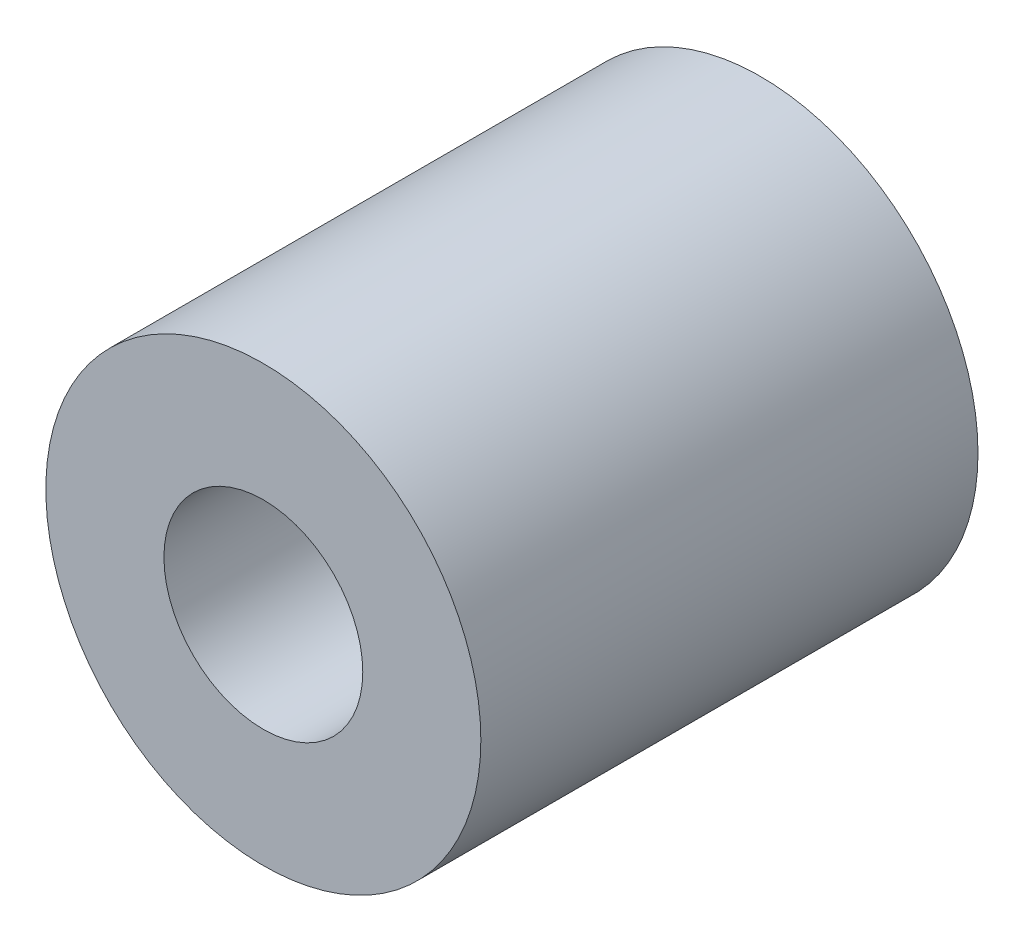
ISO-10303-21;
HEADER;
FILE_DESCRIPTION(('STEP AP214'),'2;1');
FILE_NAME('part.step','',(''),(''),'','','');
FILE_SCHEMA(('AUTOMOTIVE_DESIGN { 1 0 10303 214 1 1 1 1 }'));
ENDSEC;
DATA;
#1=APPLICATION_CONTEXT('core data for automotive mechanical design processes');
#2=APPLICATION_PROTOCOL_DEFINITION('international standard','automotive_design',2000,#1);
#3=PRODUCT_CONTEXT('',#1,'mechanical');
#4=PRODUCT('Part','Part','',(#3));
#5=PRODUCT_RELATED_PRODUCT_CATEGORY('part','',(#4));
#6=PRODUCT_DEFINITION_FORMATION('','',#4);
#7=PRODUCT_DEFINITION_CONTEXT('part definition',#1,'design');
#8=PRODUCT_DEFINITION('design','',#6,#7);
#9=PRODUCT_DEFINITION_SHAPE('','',#8);
#10=(LENGTH_UNIT() NAMED_UNIT(*) SI_UNIT(.MILLI.,.METRE.));
#11=(NAMED_UNIT(*) PLANE_ANGLE_UNIT() SI_UNIT($,.RADIAN.));
#12=(NAMED_UNIT(*) SI_UNIT($,.STERADIAN.) SOLID_ANGLE_UNIT());
#13=UNCERTAINTY_MEASURE_WITH_UNIT(LENGTH_MEASURE(1.E-05),#10,'distance_accuracy_value','');
#14=(GEOMETRIC_REPRESENTATION_CONTEXT(3) GLOBAL_UNCERTAINTY_ASSIGNED_CONTEXT((#13)) GLOBAL_UNIT_ASSIGNED_CONTEXT((#10,
#11,#12)) REPRESENTATION_CONTEXT('',''));
#15=CARTESIAN_POINT('',(0.,0.,0.));
#16=DIRECTION('',(0.,0.,1.));
#17=DIRECTION('',(1.,0.,0.));
#18=AXIS2_PLACEMENT_3D('',#15,#16,#17);
#19=CARTESIAN_POINT('',(0.,0.,4.));
#20=DIRECTION('',(0.,0.,1.));
#21=DIRECTION('',(1.,0.,0.));
#22=AXIS2_PLACEMENT_3D('',#19,#20,#21);
#23=PLANE('',#22);
#24=CARTESIAN_POINT('',(0.,0.,4.));
#25=DIRECTION('',(0.,0.,1.));
#26=DIRECTION('',(1.,0.,0.));
#27=AXIS2_PLACEMENT_3D('',#24,#25,#26);
#28=CIRCLE('',#27,3.5);
#29=CARTESIAN_POINT('',(3.5,0.,4.));
#30=VERTEX_POINT('',#29);
#31=EDGE_CURVE('E10',#30,#30,#28,.T.);
#32=ORIENTED_EDGE('',*,*,#31,.T.);
#33=EDGE_LOOP('',(#32));
#34=FACE_BOUND('',#33,.T.);
#35=CARTESIAN_POINT('',(0.,0.,4.));
#36=DIRECTION('',(0.,0.,1.));
#37=DIRECTION('',(1.,0.,0.));
#38=AXIS2_PLACEMENT_3D('',#35,#36,#37);
#39=CIRCLE('',#38,1.6);
#40=CARTESIAN_POINT('',(1.6,0.,4.));
#41=VERTEX_POINT('',#40);
#42=EDGE_CURVE('E50',#41,#41,#39,.T.);
#43=ORIENTED_EDGE('',*,*,#42,.F.);
#44=EDGE_LOOP('',(#43));
#45=FACE_BOUND('',#44,.T.);
#46=ADVANCED_FACE('F36',(#34,#45),#23,.T.);
#47=CARTESIAN_POINT('',(0.,0.,-4.));
#48=DIRECTION('',(0.,0.,1.));
#49=DIRECTION('',(1.,0.,0.));
#50=AXIS2_PLACEMENT_3D('',#47,#48,#49);
#51=PLANE('',#50);
#52=CARTESIAN_POINT('',(0.,0.,-4.));
#53=DIRECTION('',(0.,0.,1.));
#54=DIRECTION('',(1.,0.,0.));
#55=AXIS2_PLACEMENT_3D('',#52,#53,#54);
#56=CIRCLE('',#55,3.5);
#57=CARTESIAN_POINT('',(3.5,0.,-4.));
#58=VERTEX_POINT('',#57);
#59=EDGE_CURVE('E40',#58,#58,#56,.T.);
#60=ORIENTED_EDGE('',*,*,#59,.F.);
#61=EDGE_LOOP('',(#60));
#62=FACE_BOUND('',#61,.T.);
#63=CARTESIAN_POINT('',(0.,0.,-4.));
#64=DIRECTION('',(0.,0.,1.));
#65=DIRECTION('',(1.,0.,0.));
#66=AXIS2_PLACEMENT_3D('',#63,#64,#65);
#67=CIRCLE('',#66,1.6);
#68=CARTESIAN_POINT('',(1.6,0.,-4.));
#69=VERTEX_POINT('',#68);
#70=EDGE_CURVE('E52',#69,#69,#67,.T.);
#71=ORIENTED_EDGE('',*,*,#70,.T.);
#72=EDGE_LOOP('',(#71));
#73=FACE_BOUND('',#72,.T.);
#74=ADVANCED_FACE('F63',(#62,#73),#51,.F.);
#75=CARTESIAN_POINT('',(0.,0.,4.));
#76=DIRECTION('',(0.,0.,-1.));
#77=DIRECTION('',(-1.,0.,0.));
#78=AXIS2_PLACEMENT_3D('',#75,#76,#77);
#79=CYLINDRICAL_SURFACE('',#78,3.5);
#80=ORIENTED_EDGE('',*,*,#31,.F.);
#81=EDGE_LOOP('',(#80));
#82=FACE_BOUND('',#81,.T.);
#83=ORIENTED_EDGE('',*,*,#59,.T.);
#84=EDGE_LOOP('',(#83));
#85=FACE_BOUND('',#84,.T.);
#86=ADVANCED_FACE('F38',(#82,#85),#79,.T.);
#87=CARTESIAN_POINT('',(0.,0.,4.));
#88=DIRECTION('',(0.,0.,-1.));
#89=DIRECTION('',(-1.,0.,0.));
#90=AXIS2_PLACEMENT_3D('',#87,#88,#89);
#91=CYLINDRICAL_SURFACE('',#90,1.6);
#92=ORIENTED_EDGE('',*,*,#42,.T.);
#93=EDGE_LOOP('',(#92));
#94=FACE_BOUND('',#93,.T.);
#95=ORIENTED_EDGE('',*,*,#70,.F.);
#96=EDGE_LOOP('',(#95));
#97=FACE_BOUND('',#96,.T.);
#98=ADVANCED_FACE('F59',(#94,#97),#91,.F.);
#99=CLOSED_SHELL('',(#46,#74,#86,#98));
#100=MANIFOLD_SOLID_BREP('B2',#99);
#101=ADVANCED_BREP_SHAPE_REPRESENTATION('',(#18,#100),#14);
#102=SHAPE_DEFINITION_REPRESENTATION(#9,#101);
ENDSEC;
END-ISO-10303-21;
